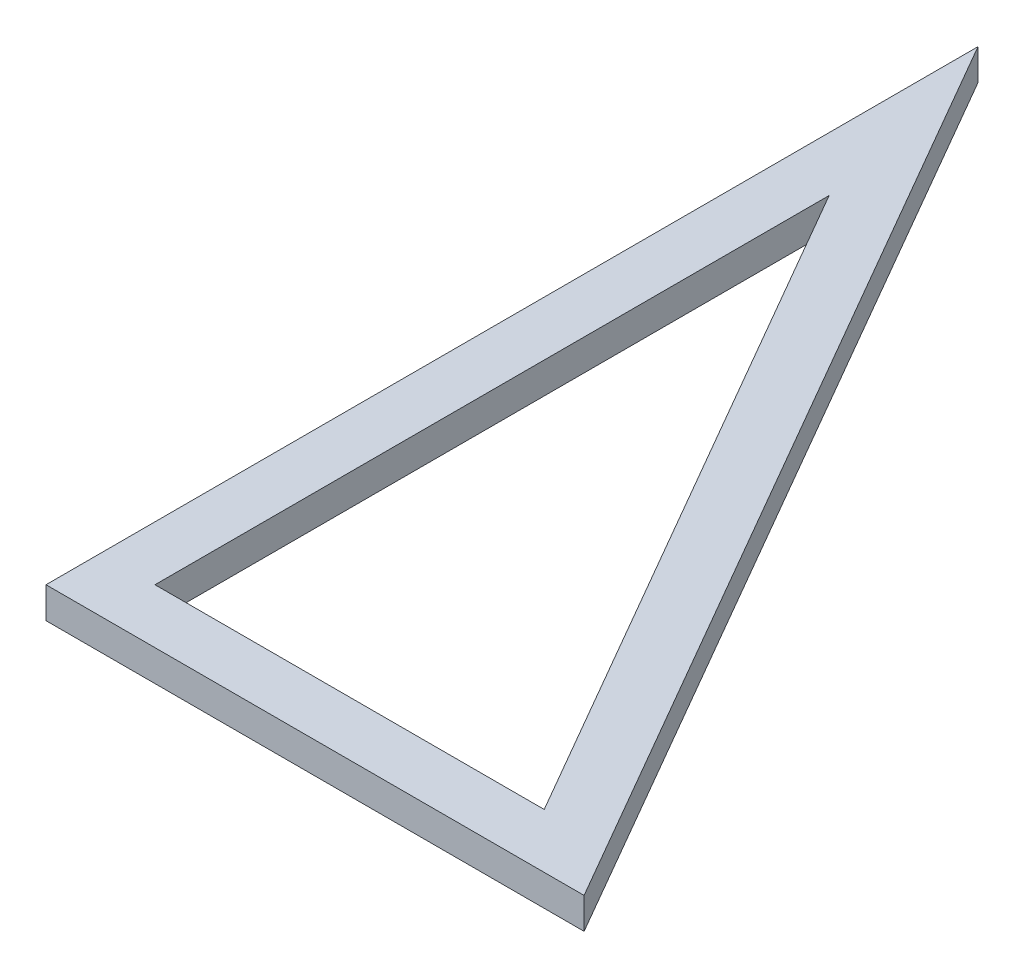
ISO-10303-21;
HEADER;
FILE_DESCRIPTION(('STEP AP214'),'2;1');
FILE_NAME('part.step','',(''),(''),'','','');
FILE_SCHEMA(('AUTOMOTIVE_DESIGN { 1 0 10303 214 1 1 1 1 }'));
ENDSEC;
DATA;
#1=APPLICATION_CONTEXT('core data for automotive mechanical design processes');
#2=APPLICATION_PROTOCOL_DEFINITION('international standard','automotive_design',2000,#1);
#3=PRODUCT_CONTEXT('',#1,'mechanical');
#4=PRODUCT('Part','Part','',(#3));
#5=PRODUCT_RELATED_PRODUCT_CATEGORY('part','',(#4));
#6=PRODUCT_DEFINITION_FORMATION('','',#4);
#7=PRODUCT_DEFINITION_CONTEXT('part definition',#1,'design');
#8=PRODUCT_DEFINITION('design','',#6,#7);
#9=PRODUCT_DEFINITION_SHAPE('','',#8);
#10=(LENGTH_UNIT() NAMED_UNIT(*) SI_UNIT(.MILLI.,.METRE.));
#11=(NAMED_UNIT(*) PLANE_ANGLE_UNIT() SI_UNIT($,.RADIAN.));
#12=(NAMED_UNIT(*) SI_UNIT($,.STERADIAN.) SOLID_ANGLE_UNIT());
#13=UNCERTAINTY_MEASURE_WITH_UNIT(LENGTH_MEASURE(1.E-05),#10,'distance_accuracy_value','');
#14=(GEOMETRIC_REPRESENTATION_CONTEXT(3) GLOBAL_UNCERTAINTY_ASSIGNED_CONTEXT((#13)) GLOBAL_UNIT_ASSIGNED_CONTEXT((#10,
#11,#12)) REPRESENTATION_CONTEXT('',''));
#15=CARTESIAN_POINT('',(0.,0.,0.));
#16=DIRECTION('',(0.,0.,1.));
#17=DIRECTION('',(1.,0.,0.));
#18=AXIS2_PLACEMENT_3D('',#15,#16,#17);
#19=CARTESIAN_POINT('',(0.,4.,0.));
#20=DIRECTION('',(0.,-1.,0.));
#21=DIRECTION('',(0.,0.,-1.));
#22=AXIS2_PLACEMENT_3D('',#19,#20,#21);
#23=PLANE('',#22);
#24=DIRECTION('',(1.,0.,0.));
#25=VECTOR('',#24,1.);
#26=CARTESIAN_POINT('',(-7.00000000000001,4.,7.));
#27=LINE('',#26,#25);
#28=CARTESIAN_POINT('',(-7.00000000000001,4.,7.));
#29=VERTEX_POINT('',#28);
#30=CARTESIAN_POINT('',(62.1243556529822,4.,7.));
#31=VERTEX_POINT('',#30);
#32=EDGE_CURVE('E115',#29,#31,#27,.T.);
#33=ORIENTED_EDGE('',*,*,#32,.T.);
#34=DIRECTION('',(-0.5,0.,-0.866025403784439));
#35=VECTOR('',#34,1.);
#36=CARTESIAN_POINT('',(62.1243556529822,4.,7.));
#37=LINE('',#36,#35);
#38=CARTESIAN_POINT('',(-7.00000000000001,4.,-112.726896031426));
#39=VERTEX_POINT('',#38);
#40=EDGE_CURVE('E118',#31,#39,#37,.T.);
#41=ORIENTED_EDGE('',*,*,#40,.T.);
#42=DIRECTION('',(0.,0.,1.));
#43=VECTOR('',#42,1.);
#44=CARTESIAN_POINT('',(-7.00000000000001,4.,-112.726896031426));
#45=LINE('',#44,#43);
#46=EDGE_CURVE('E121',#39,#29,#45,.T.);
#47=ORIENTED_EDGE('',*,*,#46,.T.);
#48=EDGE_LOOP('',(#33,#41,#47));
#49=FACE_BOUND('',#48,.T.);
#50=DIRECTION('',(-0.5,0.,-0.866025403784439));
#51=VECTOR('',#50,1.);
#52=CARTESIAN_POINT('',(50.,4.,0.));
#53=LINE('',#52,#51);
#54=CARTESIAN_POINT('',(50.,4.,0.));
#55=VERTEX_POINT('',#54);
#56=CARTESIAN_POINT('',(0.,4.,-86.6025403784439));
#57=VERTEX_POINT('',#56);
#58=EDGE_CURVE('E88',#55,#57,#53,.T.);
#59=ORIENTED_EDGE('',*,*,#58,.F.);
#60=DIRECTION('',(1.,0.,0.));
#61=VECTOR('',#60,1.);
#62=CARTESIAN_POINT('',(0.,4.,0.));
#63=LINE('',#62,#61);
#64=CARTESIAN_POINT('',(0.,4.,0.));
#65=VERTEX_POINT('',#64);
#66=EDGE_CURVE('E105',#65,#55,#63,.T.);
#67=ORIENTED_EDGE('',*,*,#66,.F.);
#68=DIRECTION('',(0.,0.,1.));
#69=VECTOR('',#68,1.);
#70=CARTESIAN_POINT('',(0.,4.,-86.6025403784439));
#71=LINE('',#70,#69);
#72=EDGE_CURVE('E96',#57,#65,#71,.T.);
#73=ORIENTED_EDGE('',*,*,#72,.F.);
#74=EDGE_LOOP('',(#59,#67,#73));
#75=FACE_BOUND('',#74,.T.);
#76=ADVANCED_FACE('F35',(#49,#75),#23,.F.);
#77=CARTESIAN_POINT('',(0.,0.,0.));
#78=DIRECTION('',(0.,-1.,0.));
#79=DIRECTION('',(0.,0.,-1.));
#80=AXIS2_PLACEMENT_3D('',#77,#78,#79);
#81=PLANE('',#80);
#82=DIRECTION('',(1.,0.,0.));
#83=VECTOR('',#82,1.);
#84=CARTESIAN_POINT('',(-7.00000000000001,0.,7.));
#85=LINE('',#84,#83);
#86=CARTESIAN_POINT('',(-7.00000000000001,0.,7.));
#87=VERTEX_POINT('',#86);
#88=CARTESIAN_POINT('',(62.1243556529822,0.,7.));
#89=VERTEX_POINT('',#88);
#90=EDGE_CURVE('E103',#87,#89,#85,.T.);
#91=ORIENTED_EDGE('',*,*,#90,.F.);
#92=DIRECTION('',(0.,0.,1.));
#93=VECTOR('',#92,1.);
#94=CARTESIAN_POINT('',(-7.00000000000001,0.,-112.726896031426));
#95=LINE('',#94,#93);
#96=CARTESIAN_POINT('',(-7.00000000000001,0.,-112.726896031426));
#97=VERTEX_POINT('',#96);
#98=EDGE_CURVE('E119',#97,#87,#95,.T.);
#99=ORIENTED_EDGE('',*,*,#98,.F.);
#100=DIRECTION('',(-0.5,0.,-0.866025403784439));
#101=VECTOR('',#100,1.);
#102=CARTESIAN_POINT('',(62.1243556529822,0.,7.));
#103=LINE('',#102,#101);
#104=EDGE_CURVE('E126',#89,#97,#103,.T.);
#105=ORIENTED_EDGE('',*,*,#104,.F.);
#106=EDGE_LOOP('',(#91,#99,#105));
#107=FACE_BOUND('',#106,.T.);
#108=DIRECTION('',(1.,0.,0.));
#109=VECTOR('',#108,1.);
#110=CARTESIAN_POINT('',(0.,0.,0.));
#111=LINE('',#110,#109);
#112=CARTESIAN_POINT('',(0.,0.,0.));
#113=VERTEX_POINT('',#112);
#114=CARTESIAN_POINT('',(50.,0.,0.));
#115=VERTEX_POINT('',#114);
#116=EDGE_CURVE('E97',#113,#115,#111,.T.);
#117=ORIENTED_EDGE('',*,*,#116,.T.);
#118=DIRECTION('',(-0.5,0.,-0.866025403784439));
#119=VECTOR('',#118,1.);
#120=CARTESIAN_POINT('',(50.,0.,0.));
#121=LINE('',#120,#119);
#122=CARTESIAN_POINT('',(0.,0.,-86.6025403784439));
#123=VERTEX_POINT('',#122);
#124=EDGE_CURVE('E58',#115,#123,#121,.T.);
#125=ORIENTED_EDGE('',*,*,#124,.T.);
#126=DIRECTION('',(0.,0.,1.));
#127=VECTOR('',#126,1.);
#128=CARTESIAN_POINT('',(0.,0.,-86.6025403784439));
#129=LINE('',#128,#127);
#130=EDGE_CURVE('E102',#123,#113,#129,.T.);
#131=ORIENTED_EDGE('',*,*,#130,.T.);
#132=EDGE_LOOP('',(#117,#125,#131));
#133=FACE_BOUND('',#132,.T.);
#134=ADVANCED_FACE('F140',(#107,#133),#81,.T.);
#135=CARTESIAN_POINT('',(-7.00000000000001,4.,7.));
#136=DIRECTION('',(0.,0.,-1.));
#137=DIRECTION('',(-1.,0.,0.));
#138=AXIS2_PLACEMENT_3D('',#135,#136,#137);
#139=PLANE('',#138);
#140=ORIENTED_EDGE('',*,*,#90,.T.);
#141=DIRECTION('',(0.,-1.,0.));
#142=VECTOR('',#141,1.);
#143=CARTESIAN_POINT('',(62.1243556529822,4.,7.));
#144=LINE('',#143,#142);
#145=EDGE_CURVE('E11',#31,#89,#144,.T.);
#146=ORIENTED_EDGE('',*,*,#145,.F.);
#147=ORIENTED_EDGE('',*,*,#32,.F.);
#148=DIRECTION('',(0.,-1.,0.));
#149=VECTOR('',#148,1.);
#150=CARTESIAN_POINT('',(-7.00000000000001,4.,7.));
#151=LINE('',#150,#149);
#152=EDGE_CURVE('E123',#29,#87,#151,.T.);
#153=ORIENTED_EDGE('',*,*,#152,.T.);
#154=EDGE_LOOP('',(#140,#146,#147,#153));
#155=FACE_BOUND('',#154,.T.);
#156=ADVANCED_FACE('F37',(#155),#139,.F.);
#157=CARTESIAN_POINT('',(62.1243556529822,4.,7.));
#158=DIRECTION('',(-0.866025403784439,0.,0.5));
#159=DIRECTION('',(0.5,0.,0.866025403784439));
#160=AXIS2_PLACEMENT_3D('',#157,#158,#159);
#161=PLANE('',#160);
#162=ORIENTED_EDGE('',*,*,#104,.T.);
#163=DIRECTION('',(0.,-1.,0.));
#164=VECTOR('',#163,1.);
#165=CARTESIAN_POINT('',(-7.00000000000001,4.,-112.726896031426));
#166=LINE('',#165,#164);
#167=EDGE_CURVE('E43',#39,#97,#166,.T.);
#168=ORIENTED_EDGE('',*,*,#167,.F.);
#169=ORIENTED_EDGE('',*,*,#40,.F.);
#170=ORIENTED_EDGE('',*,*,#145,.T.);
#171=EDGE_LOOP('',(#162,#168,#169,#170));
#172=FACE_BOUND('',#171,.T.);
#173=ADVANCED_FACE('F146',(#172),#161,.F.);
#174=CARTESIAN_POINT('',(-7.00000000000001,4.,-112.726896031426));
#175=DIRECTION('',(1.,0.,0.));
#176=DIRECTION('',(0.,0.,-1.));
#177=AXIS2_PLACEMENT_3D('',#174,#175,#176);
#178=PLANE('',#177);
#179=ORIENTED_EDGE('',*,*,#98,.T.);
#180=ORIENTED_EDGE('',*,*,#152,.F.);
#181=ORIENTED_EDGE('',*,*,#46,.F.);
#182=ORIENTED_EDGE('',*,*,#167,.T.);
#183=EDGE_LOOP('',(#179,#180,#181,#182));
#184=FACE_BOUND('',#183,.T.);
#185=ADVANCED_FACE('F135',(#184),#178,.F.);
#186=CARTESIAN_POINT('',(50.,4.,0.));
#187=DIRECTION('',(-0.866025403784439,0.,0.5));
#188=DIRECTION('',(0.5,0.,0.866025403784439));
#189=AXIS2_PLACEMENT_3D('',#186,#187,#188);
#190=PLANE('',#189);
#191=ORIENTED_EDGE('',*,*,#124,.F.);
#192=DIRECTION('',(0.,-1.,0.));
#193=VECTOR('',#192,1.);
#194=CARTESIAN_POINT('',(50.,4.,0.));
#195=LINE('',#194,#193);
#196=EDGE_CURVE('E92',#55,#115,#195,.T.);
#197=ORIENTED_EDGE('',*,*,#196,.F.);
#198=ORIENTED_EDGE('',*,*,#58,.T.);
#199=DIRECTION('',(0.,-1.,0.));
#200=VECTOR('',#199,1.);
#201=CARTESIAN_POINT('',(0.,4.,-86.6025403784439));
#202=LINE('',#201,#200);
#203=EDGE_CURVE('E91',#57,#123,#202,.T.);
#204=ORIENTED_EDGE('',*,*,#203,.T.);
#205=EDGE_LOOP('',(#191,#197,#198,#204));
#206=FACE_BOUND('',#205,.T.);
#207=ADVANCED_FACE('F90',(#206),#190,.T.);
#208=CARTESIAN_POINT('',(0.,4.,-86.6025403784439));
#209=DIRECTION('',(1.,0.,0.));
#210=DIRECTION('',(0.,0.,-1.));
#211=AXIS2_PLACEMENT_3D('',#208,#209,#210);
#212=PLANE('',#211);
#213=ORIENTED_EDGE('',*,*,#130,.F.);
#214=ORIENTED_EDGE('',*,*,#203,.F.);
#215=ORIENTED_EDGE('',*,*,#72,.T.);
#216=DIRECTION('',(0.,-1.,0.));
#217=VECTOR('',#216,1.);
#218=CARTESIAN_POINT('',(0.,4.,0.));
#219=LINE('',#218,#217);
#220=EDGE_CURVE('E50',#65,#113,#219,.T.);
#221=ORIENTED_EDGE('',*,*,#220,.T.);
#222=EDGE_LOOP('',(#213,#214,#215,#221));
#223=FACE_BOUND('',#222,.T.);
#224=ADVANCED_FACE('F100',(#223),#212,.T.);
#225=CARTESIAN_POINT('',(0.,4.,0.));
#226=DIRECTION('',(0.,0.,-1.));
#227=DIRECTION('',(-1.,0.,0.));
#228=AXIS2_PLACEMENT_3D('',#225,#226,#227);
#229=PLANE('',#228);
#230=ORIENTED_EDGE('',*,*,#116,.F.);
#231=ORIENTED_EDGE('',*,*,#220,.F.);
#232=ORIENTED_EDGE('',*,*,#66,.T.);
#233=ORIENTED_EDGE('',*,*,#196,.T.);
#234=EDGE_LOOP('',(#230,#231,#232,#233));
#235=FACE_BOUND('',#234,.T.);
#236=ADVANCED_FACE('F164',(#235),#229,.T.);
#237=CLOSED_SHELL('',(#76,#134,#156,#173,#185,#207,#224,#236));
#238=MANIFOLD_SOLID_BREP('B2',#237);
#239=ADVANCED_BREP_SHAPE_REPRESENTATION('',(#18,#238),#14);
#240=SHAPE_DEFINITION_REPRESENTATION(#9,#239);
ENDSEC;
END-ISO-10303-21;
